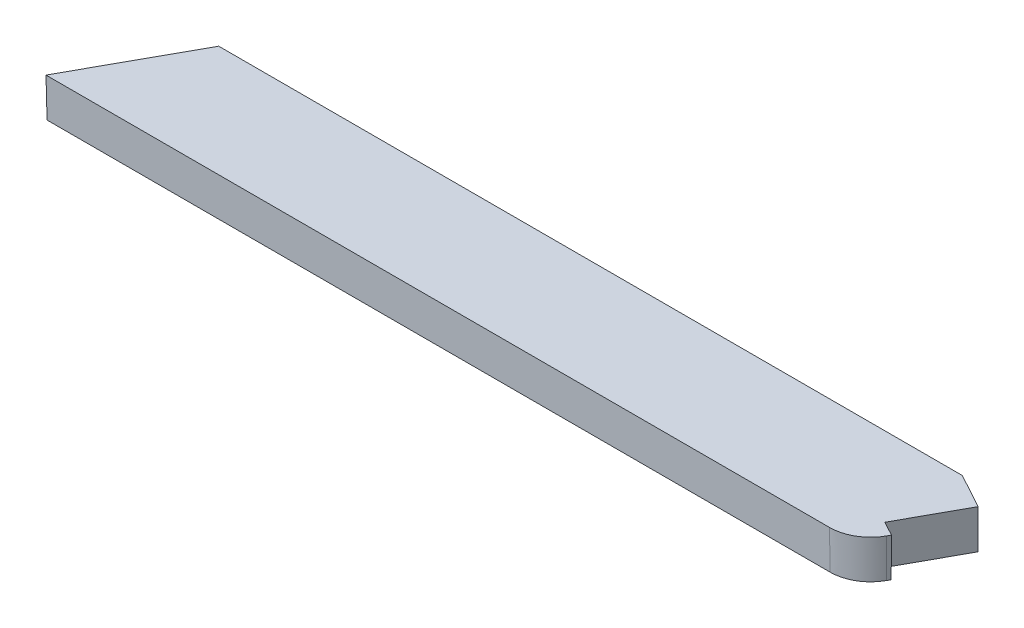
ISO-10303-21;
HEADER;
FILE_DESCRIPTION(('STEP AP214'),'2;1');
FILE_NAME('part.step','',(''),(''),'','','');
FILE_SCHEMA(('AUTOMOTIVE_DESIGN { 1 0 10303 214 1 1 1 1 }'));
ENDSEC;
DATA;
#1=APPLICATION_CONTEXT('core data for automotive mechanical design processes');
#2=APPLICATION_PROTOCOL_DEFINITION('international standard','automotive_design',2000,#1);
#3=PRODUCT_CONTEXT('',#1,'mechanical');
#4=PRODUCT('Part','Part','',(#3));
#5=PRODUCT_RELATED_PRODUCT_CATEGORY('part','',(#4));
#6=PRODUCT_DEFINITION_FORMATION('','',#4);
#7=PRODUCT_DEFINITION_CONTEXT('part definition',#1,'design');
#8=PRODUCT_DEFINITION('design','',#6,#7);
#9=PRODUCT_DEFINITION_SHAPE('','',#8);
#10=(LENGTH_UNIT() NAMED_UNIT(*) SI_UNIT(.MILLI.,.METRE.));
#11=(NAMED_UNIT(*) PLANE_ANGLE_UNIT() SI_UNIT($,.RADIAN.));
#12=(NAMED_UNIT(*) SI_UNIT($,.STERADIAN.) SOLID_ANGLE_UNIT());
#13=UNCERTAINTY_MEASURE_WITH_UNIT(LENGTH_MEASURE(1.E-05),#10,'distance_accuracy_value','');
#14=(GEOMETRIC_REPRESENTATION_CONTEXT(3) GLOBAL_UNCERTAINTY_ASSIGNED_CONTEXT((#13)) GLOBAL_UNIT_ASSIGNED_CONTEXT((#10,
#11,#12)) REPRESENTATION_CONTEXT('',''));
#15=CARTESIAN_POINT('',(0.,0.,0.));
#16=DIRECTION('',(0.,0.,1.));
#17=DIRECTION('',(1.,0.,0.));
#18=AXIS2_PLACEMENT_3D('',#15,#16,#17);
#19=CARTESIAN_POINT('',(103.199864897566,5.,0.));
#20=DIRECTION('',(0.,-0.0174524064372835,0.999847695156391));
#21=DIRECTION('',(0.,-0.999847695156391,-0.0174524064372835));
#22=AXIS2_PLACEMENT_3D('',#19,#20,#21);
#23=PLANE('',#22);
#24=DIRECTION('',(-1.,0.,0.));
#25=VECTOR('',#24,1.);
#26=CARTESIAN_POINT('',(0.,0.,-0.0872753246410881));
#27=LINE('',#26,#25);
#28=CARTESIAN_POINT('',(0.0480593906762249,0.,-0.0872753246410881));
#29=VERTEX_POINT('',#28);
#30=CARTESIAN_POINT('',(100.097496592042,0.,-0.0872753246410864));
#31=VERTEX_POINT('',#30);
#32=EDGE_CURVE('E127',#29,#31,#27,.F.);
#33=ORIENTED_EDGE('',*,*,#32,.T.);
#34=DIRECTION('',(0.,0.999847695156391,0.0174524064372835));
#35=VECTOR('',#34,1.);
#36=CARTESIAN_POINT('',(100.097496592042,5.,0.));
#37=LINE('',#36,#35);
#38=CARTESIAN_POINT('',(100.097496592042,5.,0.));
#39=VERTEX_POINT('',#38);
#40=EDGE_CURVE('E41',#31,#39,#37,.T.);
#41=ORIENTED_EDGE('',*,*,#40,.T.);
#42=DIRECTION('',(1.,0.,0.));
#43=VECTOR('',#42,1.);
#44=CARTESIAN_POINT('',(103.199864897566,5.,0.));
#45=LINE('',#44,#43);
#46=CARTESIAN_POINT('',(0.,5.,0.));
#47=VERTEX_POINT('',#46);
#48=EDGE_CURVE('E125',#47,#39,#45,.T.);
#49=ORIENTED_EDGE('',*,*,#48,.F.);
#50=DIRECTION('',(-0.00960997042116783,0.999801525357449,0.0174516005404453));
#51=VECTOR('',#50,1.);
#52=CARTESIAN_POINT('',(0.00953066557345117,4.00844918762604,-0.0173075838096145));
#53=LINE('',#52,#51);
#54=EDGE_CURVE('E134',#47,#29,#53,.F.);
#55=ORIENTED_EDGE('',*,*,#54,.T.);
#56=EDGE_LOOP('',(#33,#41,#49,#55));
#57=FACE_BOUND('',#56,.T.);
#58=ADVANCED_FACE('F31',(#57),#23,.T.);
#59=CARTESIAN_POINT('',(111.035815461315,5.,-14.23));
#60=DIRECTION('',(0.875836724513673,-0.0174524064372835,0.482291867547763));
#61=DIRECTION('',(0.482365334124539,0.,-0.8759701390087));
#62=AXIS2_PLACEMENT_3D('',#59,#60,#61);
#63=PLANE('',#62);
#64=DIRECTION('',(0.482365334124539,0.,-0.8759701390087));
#65=VECTOR('',#64,1.);
#66=CARTESIAN_POINT('',(111.035815461315,5.,-14.23));
#67=LINE('',#66,#65);
#68=CARTESIAN_POINT('',(104.696339821838,5.,-2.71758199584616));
#69=VERTEX_POINT('',#68);
#70=CARTESIAN_POINT('',(104.909775717933,5.,-3.10517923458949));
#71=VERTEX_POINT('',#70);
#72=EDGE_CURVE('E147',#69,#71,#67,.T.);
#73=ORIENTED_EDGE('',*,*,#72,.F.);
#74=DIRECTION('',(0.0152877868929036,0.999847695156391,0.00841843586239754));
#75=VECTOR('',#74,1.);
#76=CARTESIAN_POINT('',(104.696339821838,5.,-2.71758199584616));
#77=LINE('',#76,#75);
#78=CARTESIAN_POINT('',(104.61988924358,0.,-2.75968058697749));
#79=VERTEX_POINT('',#78);
#80=EDGE_CURVE('E35',#69,#79,#77,.F.);
#81=ORIENTED_EDGE('',*,*,#80,.T.);
#82=DIRECTION('',(-0.482365334124539,0.,0.8759701390087));
#83=VECTOR('',#82,1.);
#84=CARTESIAN_POINT('',(79.1112499881286,0.,43.563727613727));
#85=LINE('',#84,#83);
#86=CARTESIAN_POINT('',(104.833325139675,0.,-3.14727782572082));
#87=VERTEX_POINT('',#86);
#88=EDGE_CURVE('E123',#79,#87,#85,.F.);
#89=ORIENTED_EDGE('',*,*,#88,.T.);
#90=DIRECTION('',(-0.0152877868929036,-0.999847695156391,-0.00841843586239755));
#91=VECTOR('',#90,1.);
#92=CARTESIAN_POINT('',(104.909775717933,5.,-3.10517923458949));
#93=LINE('',#92,#91);
#94=EDGE_CURVE('E138',#87,#71,#93,.F.);
#95=ORIENTED_EDGE('',*,*,#94,.T.);
#96=EDGE_LOOP('',(#73,#81,#89,#95));
#97=FACE_BOUND('',#96,.T.);
#98=ADVANCED_FACE('F145',(#97),#63,.T.);
#99=CARTESIAN_POINT('',(7.83595056374863,5.,-14.23));
#100=DIRECTION('',(0.,0.,1.));
#101=DIRECTION('',(1.,0.,0.));
#102=AXIS2_PLACEMENT_3D('',#99,#100,#101);
#103=PLANE('',#102);
#104=DIRECTION('',(-1.,0.,0.));
#105=VECTOR('',#104,1.);
#106=CARTESIAN_POINT('',(7.83595056374863,5.,-14.23));
#107=LINE('',#106,#105);
#108=CARTESIAN_POINT('',(102.847001463789,5.,-14.23));
#109=VERTEX_POINT('',#108);
#110=CARTESIAN_POINT('',(7.83595056374863,5.,-14.23));
#111=VERTEX_POINT('',#110);
#112=EDGE_CURVE('E116',#109,#111,#107,.T.);
#113=ORIENTED_EDGE('',*,*,#112,.F.);
#114=DIRECTION('',(0.,1.,0.));
#115=VECTOR('',#114,1.);
#116=CARTESIAN_POINT('',(102.847001463789,-0.00100000000000013,-14.23));
#117=LINE('',#116,#115);
#118=CARTESIAN_POINT('',(102.847001463789,0.,-14.23));
#119=VERTEX_POINT('',#118);
#120=EDGE_CURVE('E103',#119,#109,#117,.T.);
#121=ORIENTED_EDGE('',*,*,#120,.F.);
#122=DIRECTION('',(-1.,0.,0.));
#123=VECTOR('',#122,1.);
#124=CARTESIAN_POINT('',(7.83595056374863,0.,-14.23));
#125=LINE('',#124,#123);
#126=CARTESIAN_POINT('',(7.83595056374863,0.,-14.23));
#127=VERTEX_POINT('',#126);
#128=EDGE_CURVE('E114',#119,#127,#125,.T.);
#129=ORIENTED_EDGE('',*,*,#128,.T.);
#130=DIRECTION('',(0.,-1.,0.));
#131=VECTOR('',#130,1.);
#132=CARTESIAN_POINT('',(7.83595056374863,5.,-14.23));
#133=LINE('',#132,#131);
#134=EDGE_CURVE('E133',#111,#127,#133,.T.);
#135=ORIENTED_EDGE('',*,*,#134,.F.);
#136=EDGE_LOOP('',(#113,#121,#129,#135));
#137=FACE_BOUND('',#136,.T.);
#138=ADVANCED_FACE('F112',(#137),#103,.F.);
#139=CARTESIAN_POINT('',(0.,5.,0.));
#140=DIRECTION('',(0.8759701390087,0.,0.482365334124539));
#141=DIRECTION('',(0.482365334124539,0.,-0.8759701390087));
#142=AXIS2_PLACEMENT_3D('',#139,#140,#141);
#143=PLANE('',#142);
#144=DIRECTION('',(-0.482365334124539,0.,0.8759701390087));
#145=VECTOR('',#144,1.);
#146=CARTESIAN_POINT('',(0.,0.,0.));
#147=LINE('',#146,#145);
#148=EDGE_CURVE('E122',#127,#29,#147,.T.);
#149=ORIENTED_EDGE('',*,*,#148,.T.);
#150=ORIENTED_EDGE('',*,*,#54,.F.);
#151=DIRECTION('',(-0.482365334124539,0.,0.8759701390087));
#152=VECTOR('',#151,1.);
#153=CARTESIAN_POINT('',(0.,5.,0.));
#154=LINE('',#153,#152);
#155=EDGE_CURVE('E130',#111,#47,#154,.T.);
#156=ORIENTED_EDGE('',*,*,#155,.F.);
#157=ORIENTED_EDGE('',*,*,#134,.T.);
#158=EDGE_LOOP('',(#149,#150,#156,#157));
#159=FACE_BOUND('',#158,.T.);
#160=ADVANCED_FACE('F170',(#159),#143,.F.);
#161=CARTESIAN_POINT('',(0.,5.,0.));
#162=DIRECTION('',(0.,-1.,0.));
#163=DIRECTION('',(0.,0.,-1.));
#164=AXIS2_PLACEMENT_3D('',#161,#162,#163);
#165=PLANE('',#164);
#166=ORIENTED_EDGE('',*,*,#48,.T.);
#167=CARTESIAN_POINT('',(100.097496592042,5.,-5.25));
#168=DIRECTION('',(0.,-1.,0.));
#169=DIRECTION('',(0.,0.,-1.));
#170=AXIS2_PLACEMENT_3D('',#167,#168,#169);
#171=CIRCLE('',#170,5.25);
#172=EDGE_CURVE('E11',#39,#69,#171,.F.);
#173=ORIENTED_EDGE('',*,*,#172,.T.);
#174=ORIENTED_EDGE('',*,*,#72,.T.);
#175=DIRECTION('',(0.8759701390087,0.,0.48236533412454));
#176=VECTOR('',#175,1.);
#177=CARTESIAN_POINT('',(104.909775717933,5.,-3.10517923458949));
#178=LINE('',#177,#176);
#179=CARTESIAN_POINT('',(103.070238426015,5.,-4.11814643625103));
#180=VERTEX_POINT('',#179);
#181=EDGE_CURVE('E157',#180,#71,#178,.T.);
#182=ORIENTED_EDGE('',*,*,#181,.F.);
#183=DIRECTION('',(-0.482365334124539,0.,0.875970139008701));
#184=VECTOR('',#183,1.);
#185=CARTESIAN_POINT('',(108.638473467013,5.,-14.23));
#186=LINE('',#185,#184);
#187=CARTESIAN_POINT('',(107.290935099604,5.,-11.7828851525772));
#188=VERTEX_POINT('',#187);
#189=EDGE_CURVE('E155',#188,#180,#186,.T.);
#190=ORIENTED_EDGE('',*,*,#189,.F.);
#191=DIRECTION('',(0.8759701390087,0.,0.48236533412454));
#192=VECTOR('',#191,1.);
#193=CARTESIAN_POINT('',(107.290935099604,5.,-11.7828851525772));
#194=LINE('',#193,#192);
#195=EDGE_CURVE('E77',#109,#188,#194,.T.);
#196=ORIENTED_EDGE('',*,*,#195,.F.);
#197=ORIENTED_EDGE('',*,*,#112,.T.);
#198=ORIENTED_EDGE('',*,*,#155,.T.);
#199=EDGE_LOOP('',(#166,#173,#174,#182,#190,#196,#197,#198));
#200=FACE_BOUND('',#199,.T.);
#201=ADVANCED_FACE('F168',(#200),#165,.F.);
#202=CARTESIAN_POINT('',(0.,0.,0.));
#203=DIRECTION('',(0.,-1.,0.));
#204=DIRECTION('',(0.,0.,-1.));
#205=AXIS2_PLACEMENT_3D('',#202,#203,#204);
#206=PLANE('',#205);
#207=ORIENTED_EDGE('',*,*,#88,.F.);
#208=CARTESIAN_POINT('',(100.097496592042,0.,-5.25));
#209=DIRECTION('',(0.,-1.,0.));
#210=DIRECTION('',(0.,0.,-1.));
#211=AXIS2_PLACEMENT_3D('',#208,#209,#210);
#212=CIRCLE('',#211,5.16272467535891);
#213=EDGE_CURVE('E69',#79,#31,#212,.T.);
#214=ORIENTED_EDGE('',*,*,#213,.T.);
#215=ORIENTED_EDGE('',*,*,#32,.F.);
#216=ORIENTED_EDGE('',*,*,#148,.F.);
#217=ORIENTED_EDGE('',*,*,#128,.F.);
#218=DIRECTION('',(0.8759701390087,0.,0.48236533412454));
#219=VECTOR('',#218,1.);
#220=CARTESIAN_POINT('',(107.290935099604,0.,-11.7828851525772));
#221=LINE('',#220,#219);
#222=CARTESIAN_POINT('',(107.290935099604,0.,-11.7828851525772));
#223=VERTEX_POINT('',#222);
#224=EDGE_CURVE('E100',#119,#223,#221,.T.);
#225=ORIENTED_EDGE('',*,*,#224,.T.);
#226=DIRECTION('',(-0.482365334124539,0.,0.875970139008701));
#227=VECTOR('',#226,1.);
#228=CARTESIAN_POINT('',(108.638473467013,0.,-14.23));
#229=LINE('',#228,#227);
#230=CARTESIAN_POINT('',(103.070238426015,0.,-4.11814643625102));
#231=VERTEX_POINT('',#230);
#232=EDGE_CURVE('E108',#223,#231,#229,.T.);
#233=ORIENTED_EDGE('',*,*,#232,.T.);
#234=DIRECTION('',(0.8759701390087,0.,0.48236533412454));
#235=VECTOR('',#234,1.);
#236=CARTESIAN_POINT('',(104.909775717933,0.,-3.10517923458949));
#237=LINE('',#236,#235);
#238=EDGE_CURVE('E151',#231,#87,#237,.T.);
#239=ORIENTED_EDGE('',*,*,#238,.T.);
#240=EDGE_LOOP('',(#207,#214,#215,#216,#217,#225,#233,#239));
#241=FACE_BOUND('',#240,.T.);
#242=ADVANCED_FACE('F120',(#241),#206,.T.);
#243=CARTESIAN_POINT('',(104.909775717933,-0.00100000000000013,-3.10517923458949));
#244=DIRECTION('',(-0.48236533412454,0.,0.8759701390087));
#245=DIRECTION('',(0.8759701390087,0.,0.48236533412454));
#246=AXIS2_PLACEMENT_3D('',#243,#244,#245);
#247=PLANE('',#246);
#248=DIRECTION('',(0.,1.,0.));
#249=VECTOR('',#248,1.);
#250=CARTESIAN_POINT('',(103.070238426015,-0.00100000000000013,-4.11814643625103));
#251=LINE('',#250,#249);
#252=EDGE_CURVE('E142',#231,#180,#251,.T.);
#253=ORIENTED_EDGE('',*,*,#252,.T.);
#254=ORIENTED_EDGE('',*,*,#181,.T.);
#255=ORIENTED_EDGE('',*,*,#94,.F.);
#256=ORIENTED_EDGE('',*,*,#238,.F.);
#257=EDGE_LOOP('',(#253,#254,#255,#256));
#258=FACE_BOUND('',#257,.T.);
#259=ADVANCED_FACE('F183',(#258),#247,.F.);
#260=CARTESIAN_POINT('',(108.638473467013,-0.00100000000000013,-14.23));
#261=DIRECTION('',(-0.875970139008701,0.,-0.482365334124539));
#262=DIRECTION('',(-0.482365334124539,0.,0.875970139008701));
#263=AXIS2_PLACEMENT_3D('',#260,#261,#262);
#264=PLANE('',#263);
#265=ORIENTED_EDGE('',*,*,#232,.F.);
#266=DIRECTION('',(0.,1.,0.));
#267=VECTOR('',#266,1.);
#268=CARTESIAN_POINT('',(107.290935099604,-0.00100000000000013,-11.7828851525772));
#269=LINE('',#268,#267);
#270=EDGE_CURVE('E104',#223,#188,#269,.T.);
#271=ORIENTED_EDGE('',*,*,#270,.T.);
#272=ORIENTED_EDGE('',*,*,#189,.T.);
#273=ORIENTED_EDGE('',*,*,#252,.F.);
#274=EDGE_LOOP('',(#265,#271,#272,#273));
#275=FACE_BOUND('',#274,.T.);
#276=ADVANCED_FACE('F186',(#275),#264,.F.);
#277=CARTESIAN_POINT('',(107.290935099604,-0.00100000000000013,-11.7828851525772));
#278=DIRECTION('',(-0.48236533412454,0.,0.8759701390087));
#279=DIRECTION('',(0.8759701390087,0.,0.48236533412454));
#280=AXIS2_PLACEMENT_3D('',#277,#278,#279);
#281=PLANE('',#280);
#282=ORIENTED_EDGE('',*,*,#120,.T.);
#283=ORIENTED_EDGE('',*,*,#195,.T.);
#284=ORIENTED_EDGE('',*,*,#270,.F.);
#285=ORIENTED_EDGE('',*,*,#224,.F.);
#286=EDGE_LOOP('',(#282,#283,#284,#285));
#287=FACE_BOUND('',#286,.T.);
#288=ADVANCED_FACE('F102',(#287),#281,.F.);
#289=CARTESIAN_POINT('',(100.097496592042,5.,-5.25));
#290=DIRECTION('',(0.,1.,0.));
#291=DIRECTION('',(0.,0.,-1.));
#292=AXIS2_PLACEMENT_3D('',#289,#290,#291);
#293=CONICAL_SURFACE('',#292,5.25,0.0174532925199433);
#294=ORIENTED_EDGE('',*,*,#172,.F.);
#295=ORIENTED_EDGE('',*,*,#40,.F.);
#296=ORIENTED_EDGE('',*,*,#213,.F.);
#297=ORIENTED_EDGE('',*,*,#80,.F.);
#298=EDGE_LOOP('',(#294,#295,#296,#297));
#299=FACE_BOUND('',#298,.T.);
#300=ADVANCED_FACE('F33',(#299),#293,.T.);
#301=CLOSED_SHELL('',(#58,#98,#138,#160,#201,#242,#259,#276,#288,#300));
#302=MANIFOLD_SOLID_BREP('B2',#301);
#303=ADVANCED_BREP_SHAPE_REPRESENTATION('',(#18,#302),#14);
#304=SHAPE_DEFINITION_REPRESENTATION(#9,#303);
ENDSEC;
END-ISO-10303-21;
